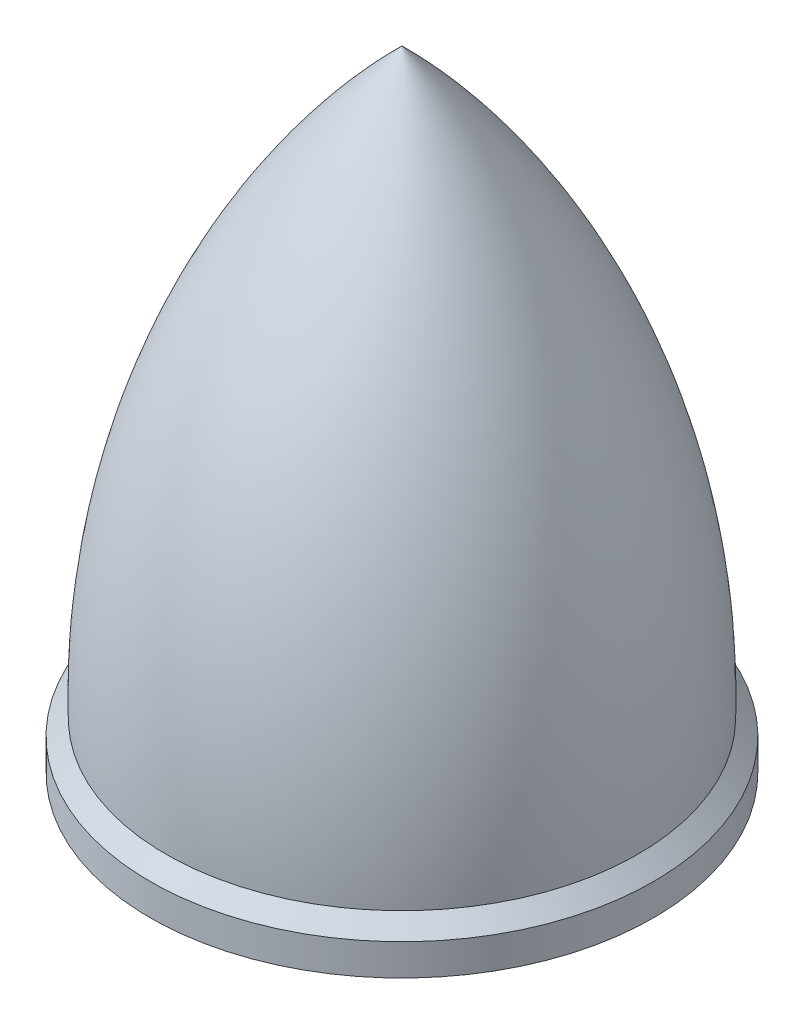
ISO-10303-21;
HEADER;
FILE_DESCRIPTION(('STEP AP214'),'2;1');
FILE_NAME('part.step','',(''),(''),'','','');
FILE_SCHEMA(('AUTOMOTIVE_DESIGN { 1 0 10303 214 1 1 1 1 }'));
ENDSEC;
DATA;
#1=APPLICATION_CONTEXT('core data for automotive mechanical design processes');
#2=APPLICATION_PROTOCOL_DEFINITION('international standard','automotive_design',2000,#1);
#3=PRODUCT_CONTEXT('',#1,'mechanical');
#4=PRODUCT('Part','Part','',(#3));
#5=PRODUCT_RELATED_PRODUCT_CATEGORY('part','',(#4));
#6=PRODUCT_DEFINITION_FORMATION('','',#4);
#7=PRODUCT_DEFINITION_CONTEXT('part definition',#1,'design');
#8=PRODUCT_DEFINITION('design','',#6,#7);
#9=PRODUCT_DEFINITION_SHAPE('','',#8);
#10=(LENGTH_UNIT() NAMED_UNIT(*) SI_UNIT(.MILLI.,.METRE.));
#11=(NAMED_UNIT(*) PLANE_ANGLE_UNIT() SI_UNIT($,.RADIAN.));
#12=(NAMED_UNIT(*) SI_UNIT($,.STERADIAN.) SOLID_ANGLE_UNIT());
#13=UNCERTAINTY_MEASURE_WITH_UNIT(LENGTH_MEASURE(1.E-05),#10,'distance_accuracy_value','');
#14=(GEOMETRIC_REPRESENTATION_CONTEXT(3) GLOBAL_UNCERTAINTY_ASSIGNED_CONTEXT((#13)) GLOBAL_UNIT_ASSIGNED_CONTEXT((#10,
#11,#12)) REPRESENTATION_CONTEXT('',''));
#15=CARTESIAN_POINT('',(0.,0.,0.));
#16=DIRECTION('',(0.,0.,1.));
#17=DIRECTION('',(1.,0.,0.));
#18=AXIS2_PLACEMENT_3D('',#15,#16,#17);
#19=CARTESIAN_POINT('',(0.,0.,0.));
#20=DIRECTION('',(0.,-1.,0.));
#21=DIRECTION('',(0.,0.,-1.));
#22=AXIS2_PLACEMENT_3D('',#19,#20,#21);
#23=PLANE('',#22);
#24=CARTESIAN_POINT('',(0.,0.,0.));
#25=DIRECTION('',(0.,-1.,0.));
#26=DIRECTION('',(0.,0.,-1.));
#27=AXIS2_PLACEMENT_3D('',#24,#25,#26);
#28=CIRCLE('',#27,2.5);
#29=CARTESIAN_POINT('',(0.,0.,-2.5));
#30=VERTEX_POINT('',#29);
#31=EDGE_CURVE('E59',#30,#30,#28,.T.);
#32=ORIENTED_EDGE('',*,*,#31,.F.);
#33=EDGE_LOOP('',(#32));
#34=FACE_BOUND('',#33,.T.);
#35=CARTESIAN_POINT('',(0.,0.,0.));
#36=DIRECTION('',(0.,-1.,0.));
#37=DIRECTION('',(0.,0.,-1.));
#38=AXIS2_PLACEMENT_3D('',#35,#36,#37);
#39=CIRCLE('',#38,8.);
#40=CARTESIAN_POINT('',(0.,0.,-8.));
#41=VERTEX_POINT('',#40);
#42=EDGE_CURVE('E11',#41,#41,#39,.T.);
#43=ORIENTED_EDGE('',*,*,#42,.T.);
#44=EDGE_LOOP('',(#43));
#45=FACE_BOUND('',#44,.T.);
#46=ADVANCED_FACE('F35',(#34,#45),#23,.T.);
#47=CARTESIAN_POINT('',(0.,0.,0.));
#48=DIRECTION('',(0.,-1.,0.));
#49=DIRECTION('',(0.,0.,-1.));
#50=AXIS2_PLACEMENT_3D('',#47,#48,#49);
#51=CYLINDRICAL_SURFACE('',#50,8.);
#52=CARTESIAN_POINT('',(0.,1.,0.));
#53=DIRECTION('',(0.,-1.,0.));
#54=DIRECTION('',(0.,0.,-1.));
#55=AXIS2_PLACEMENT_3D('',#52,#53,#54);
#56=CIRCLE('',#55,8.);
#57=CARTESIAN_POINT('',(0.,1.,-8.));
#58=VERTEX_POINT('',#57);
#59=EDGE_CURVE('E42',#58,#58,#56,.T.);
#60=ORIENTED_EDGE('',*,*,#59,.T.);
#61=EDGE_LOOP('',(#60));
#62=FACE_BOUND('',#61,.T.);
#63=ORIENTED_EDGE('',*,*,#42,.F.);
#64=EDGE_LOOP('',(#63));
#65=FACE_BOUND('',#64,.T.);
#66=ADVANCED_FACE('F68',(#62,#65),#51,.T.);
#67=CARTESIAN_POINT('',(0.,1.,0.));
#68=DIRECTION('',(0.,-1.,0.));
#69=DIRECTION('',(0.,0.,-1.));
#70=AXIS2_PLACEMENT_3D('',#67,#68,#69);
#71=CONICAL_SURFACE('',#70,8.,0.785398163397449);
#72=CARTESIAN_POINT('',(0.,1.5,0.));
#73=DIRECTION('',(0.,-1.,0.));
#74=DIRECTION('',(0.,0.,-1.));
#75=AXIS2_PLACEMENT_3D('',#72,#73,#74);
#76=CIRCLE('',#75,7.5);
#77=CARTESIAN_POINT('',(0.,1.5,-7.5));
#78=VERTEX_POINT('',#77);
#79=EDGE_CURVE('E58',#78,#78,#76,.T.);
#80=ORIENTED_EDGE('',*,*,#79,.T.);
#81=EDGE_LOOP('',(#80));
#82=FACE_BOUND('',#81,.T.);
#83=ORIENTED_EDGE('',*,*,#59,.F.);
#84=EDGE_LOOP('',(#83));
#85=FACE_BOUND('',#84,.T.);
#86=ADVANCED_FACE('F71',(#82,#85),#71,.T.);
#87=CARTESIAN_POINT('',(0.,2.1384405908124,17.4918465426627));
#88=DIRECTION('',(-1.,0.,0.));
#89=DIRECTION('',(0.,0.,-1.));
#90=AXIS2_PLACEMENT_3D('',#87,#88,#89);
#91=CIRCLE('',#90,25.);
#92=TRIMMED_CURVE('',#91,(PARAMETER_VALUE(-0.795855412987337)),
(PARAMETER_VALUE(0.795855412987337)),.T.,.PARAMETER.);
#93=CARTESIAN_POINT('',(0.,2.1384405908124,0.));
#94=DIRECTION('',(0.,-1.,0.));
#95=AXIS1_PLACEMENT('',#93,#94);
#96=SURFACE_OF_REVOLUTION('',#92,#95);
#97=CARTESIAN_POINT('',(0.,20.,0.));
#98=VERTEX_POINT('',#97);
#99=VERTEX_LOOP('',#98);
#100=FACE_BOUND('',#99,.T.);
#101=ORIENTED_EDGE('',*,*,#79,.F.);
#102=EDGE_LOOP('',(#101));
#103=FACE_BOUND('',#102,.T.);
#104=ADVANCED_FACE('F52',(#100,#103),#96,.T.);
#105=CARTESIAN_POINT('',(0.,10.,0.));
#106=DIRECTION('',(0.,-1.,0.));
#107=DIRECTION('',(0.,0.,-1.));
#108=AXIS2_PLACEMENT_3D('',#105,#106,#107);
#109=CONICAL_SURFACE('',#108,2.5,1.02974425867665);
#110=CARTESIAN_POINT('',(0.,11.5021515475689,0.));
#111=VERTEX_POINT('',#110);
#112=VERTEX_LOOP('',#111);
#113=FACE_BOUND('',#112,.T.);
#114=CARTESIAN_POINT('',(0.,10.,0.));
#115=DIRECTION('',(0.,-1.,0.));
#116=DIRECTION('',(0.,0.,-1.));
#117=AXIS2_PLACEMENT_3D('',#114,#115,#116);
#118=CIRCLE('',#117,2.5);
#119=CARTESIAN_POINT('',(0.,10.,-2.5));
#120=VERTEX_POINT('',#119);
#121=EDGE_CURVE('E56',#120,#120,#118,.T.);
#122=ORIENTED_EDGE('',*,*,#121,.T.);
#123=EDGE_LOOP('',(#122));
#124=FACE_BOUND('',#123,.T.);
#125=ADVANCED_FACE('F48',(#113,#124),#109,.F.);
#126=CARTESIAN_POINT('',(0.,0.,0.));
#127=DIRECTION('',(0.,-1.,0.));
#128=DIRECTION('',(0.,0.,-1.));
#129=AXIS2_PLACEMENT_3D('',#126,#127,#128);
#130=CYLINDRICAL_SURFACE('',#129,2.5);
#131=ORIENTED_EDGE('',*,*,#121,.F.);
#132=EDGE_LOOP('',(#131));
#133=FACE_BOUND('',#132,.T.);
#134=ORIENTED_EDGE('',*,*,#31,.T.);
#135=EDGE_LOOP('',(#134));
#136=FACE_BOUND('',#135,.T.);
#137=ADVANCED_FACE('F51',(#133,#136),#130,.F.);
#138=CLOSED_SHELL('',(#46,#66,#86,#104,#125,#137));
#139=MANIFOLD_SOLID_BREP('B2',#138);
#140=ADVANCED_BREP_SHAPE_REPRESENTATION('',(#18,#139),#14);
#141=SHAPE_DEFINITION_REPRESENTATION(#9,#140);
ENDSEC;
END-ISO-10303-21;
